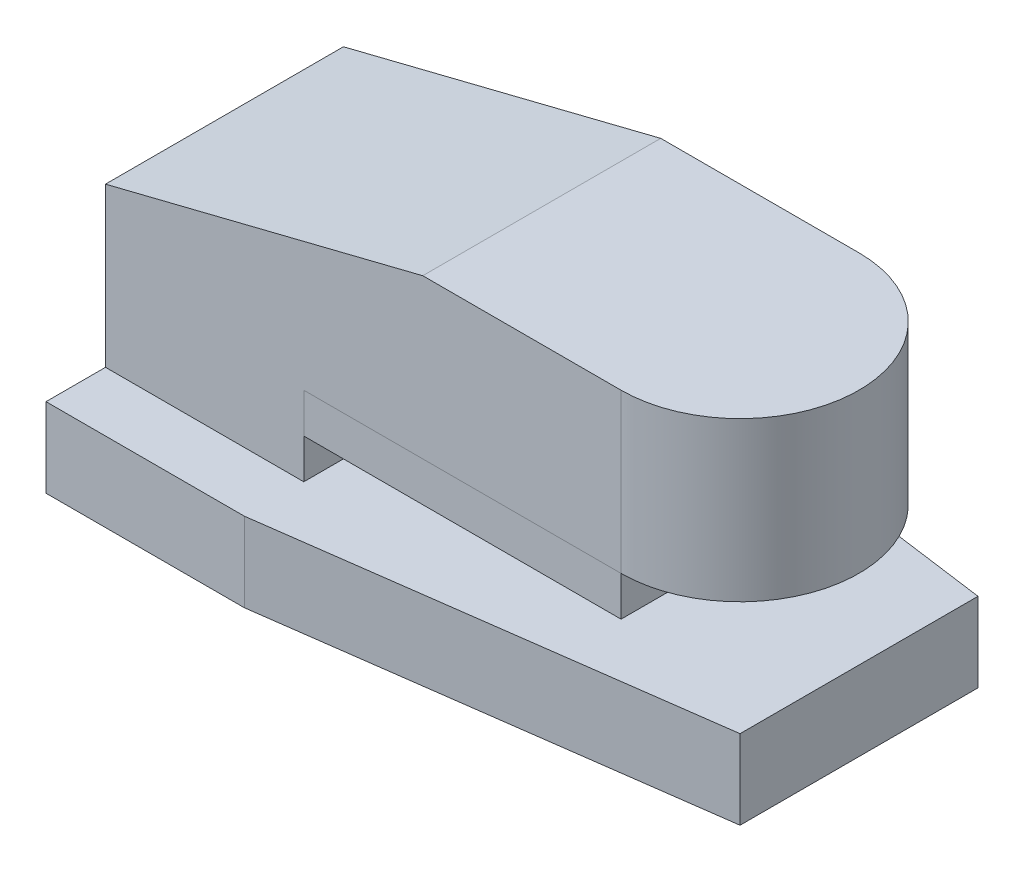
ISO-10303-21;
HEADER;
FILE_DESCRIPTION(('STEP AP214'),'2;1');
FILE_NAME('part.step','',(''),(''),'','','');
FILE_SCHEMA(('AUTOMOTIVE_DESIGN { 1 0 10303 214 1 1 1 1 }'));
ENDSEC;
DATA;
#1=APPLICATION_CONTEXT('core data for automotive mechanical design processes');
#2=APPLICATION_PROTOCOL_DEFINITION('international standard','automotive_design',2000,#1);
#3=PRODUCT_CONTEXT('',#1,'mechanical');
#4=PRODUCT('Part','Part','',(#3));
#5=PRODUCT_RELATED_PRODUCT_CATEGORY('part','',(#4));
#6=PRODUCT_DEFINITION_FORMATION('','',#4);
#7=PRODUCT_DEFINITION_CONTEXT('part definition',#1,'design');
#8=PRODUCT_DEFINITION('design','',#6,#7);
#9=PRODUCT_DEFINITION_SHAPE('','',#8);
#10=(LENGTH_UNIT() NAMED_UNIT(*) SI_UNIT(.MILLI.,.METRE.));
#11=(NAMED_UNIT(*) PLANE_ANGLE_UNIT() SI_UNIT($,.RADIAN.));
#12=(NAMED_UNIT(*) SI_UNIT($,.STERADIAN.) SOLID_ANGLE_UNIT());
#13=UNCERTAINTY_MEASURE_WITH_UNIT(LENGTH_MEASURE(1.E-05),#10,'distance_accuracy_value','');
#14=(GEOMETRIC_REPRESENTATION_CONTEXT(3) GLOBAL_UNCERTAINTY_ASSIGNED_CONTEXT((#13)) GLOBAL_UNIT_ASSIGNED_CONTEXT((#10,
#11,#12)) REPRESENTATION_CONTEXT('',''));
#15=CARTESIAN_POINT('',(0.,0.,0.));
#16=DIRECTION('',(0.,0.,1.));
#17=DIRECTION('',(1.,0.,0.));
#18=AXIS2_PLACEMENT_3D('',#15,#16,#17);
#19=CARTESIAN_POINT('',(130.,-83.0549270657776,-75.));
#20=DIRECTION('',(-1.,0.,0.));
#21=DIRECTION('',(0.,0.,1.));
#22=AXIS2_PLACEMENT_3D('',#19,#20,#21);
#23=PLANE('',#22);
#24=DIRECTION('',(0.,-1.,0.));
#25=VECTOR('',#24,1.);
#26=CARTESIAN_POINT('',(130.,-83.0549270657776,-15.));
#27=LINE('',#26,#25);
#28=CARTESIAN_POINT('',(130.,40.,-15.));
#29=VERTEX_POINT('',#28);
#30=CARTESIAN_POINT('',(130.,30.,-15.));
#31=VERTEX_POINT('',#30);
#32=EDGE_CURVE('E107',#29,#31,#27,.T.);
#33=ORIENTED_EDGE('',*,*,#32,.T.);
#34=DIRECTION('',(0.,0.,1.));
#35=VECTOR('',#34,1.);
#36=CARTESIAN_POINT('',(130.,30.,-75.));
#37=LINE('',#36,#35);
#38=CARTESIAN_POINT('',(130.,30.,-75.));
#39=VERTEX_POINT('',#38);
#40=EDGE_CURVE('E12',#39,#31,#37,.T.);
#41=ORIENTED_EDGE('',*,*,#40,.F.);
#42=DIRECTION('',(0.,-1.,0.));
#43=VECTOR('',#42,1.);
#44=CARTESIAN_POINT('',(130.,-83.0549270657776,-75.));
#45=LINE('',#44,#43);
#46=CARTESIAN_POINT('',(130.,40.,-75.));
#47=VERTEX_POINT('',#46);
#48=EDGE_CURVE('E62',#47,#39,#45,.T.);
#49=ORIENTED_EDGE('',*,*,#48,.F.);
#50=DIRECTION('',(0.,0.,1.));
#51=VECTOR('',#50,1.);
#52=CARTESIAN_POINT('',(130.,40.,-75.));
#53=LINE('',#52,#51);
#54=EDGE_CURVE('E47',#47,#29,#53,.T.);
#55=ORIENTED_EDGE('',*,*,#54,.T.);
#56=EDGE_LOOP('',(#33,#41,#49,#55));
#57=FACE_BOUND('',#56,.T.);
#58=ADVANCED_FACE('F44',(#57),#23,.F.);
#59=CARTESIAN_POINT('',(80.,30.,-75.));
#60=DIRECTION('',(0.,-1.,0.));
#61=DIRECTION('',(0.,0.,-1.));
#62=AXIS2_PLACEMENT_3D('',#59,#60,#61);
#63=PLANE('',#62);
#64=DIRECTION('',(1.,0.,0.));
#65=VECTOR('',#64,1.);
#66=CARTESIAN_POINT('',(80.,30.,-15.));
#67=LINE('',#66,#65);
#68=CARTESIAN_POINT('',(50.,30.,-15.));
#69=VERTEX_POINT('',#68);
#70=EDGE_CURVE('E103',#69,#31,#67,.T.);
#71=ORIENTED_EDGE('',*,*,#70,.F.);
#72=DIRECTION('',(0.,0.,1.));
#73=VECTOR('',#72,1.);
#74=CARTESIAN_POINT('',(50.,30.,-75.));
#75=LINE('',#74,#73);
#76=CARTESIAN_POINT('',(50.,30.,-75.));
#77=VERTEX_POINT('',#76);
#78=EDGE_CURVE('E53',#77,#69,#75,.T.);
#79=ORIENTED_EDGE('',*,*,#78,.F.);
#80=DIRECTION('',(1.,0.,0.));
#81=VECTOR('',#80,1.);
#82=CARTESIAN_POINT('',(80.,30.,-75.));
#83=LINE('',#82,#81);
#84=EDGE_CURVE('E92',#77,#39,#83,.T.);
#85=ORIENTED_EDGE('',*,*,#84,.T.);
#86=ORIENTED_EDGE('',*,*,#40,.T.);
#87=EDGE_LOOP('',(#71,#79,#85,#86));
#88=FACE_BOUND('',#87,.T.);
#89=ADVANCED_FACE('F117',(#88),#63,.T.);
#90=CARTESIAN_POINT('',(50.,-83.0549270657776,-75.));
#91=DIRECTION('',(1.,0.,0.));
#92=DIRECTION('',(0.,0.,-1.));
#93=AXIS2_PLACEMENT_3D('',#90,#91,#92);
#94=PLANE('',#93);
#95=DIRECTION('',(0.,1.,0.));
#96=VECTOR('',#95,1.);
#97=CARTESIAN_POINT('',(50.,-83.0549270657776,-15.));
#98=LINE('',#97,#96);
#99=CARTESIAN_POINT('',(50.,40.,-15.));
#100=VERTEX_POINT('',#99);
#101=EDGE_CURVE('E97',#69,#100,#98,.T.);
#102=ORIENTED_EDGE('',*,*,#101,.T.);
#103=DIRECTION('',(0.,0.,1.));
#104=VECTOR('',#103,1.);
#105=CARTESIAN_POINT('',(50.,40.,-75.));
#106=LINE('',#105,#104);
#107=CARTESIAN_POINT('',(50.,40.,-75.));
#108=VERTEX_POINT('',#107);
#109=EDGE_CURVE('E95',#108,#100,#106,.T.);
#110=ORIENTED_EDGE('',*,*,#109,.F.);
#111=DIRECTION('',(0.,1.,0.));
#112=VECTOR('',#111,1.);
#113=CARTESIAN_POINT('',(50.,-83.0549270657776,-75.));
#114=LINE('',#113,#112);
#115=EDGE_CURVE('E89',#77,#108,#114,.T.);
#116=ORIENTED_EDGE('',*,*,#115,.F.);
#117=ORIENTED_EDGE('',*,*,#78,.T.);
#118=EDGE_LOOP('',(#102,#110,#116,#117));
#119=FACE_BOUND('',#118,.T.);
#120=ADVANCED_FACE('F96',(#119),#94,.F.);
#121=CARTESIAN_POINT('',(80.,40.,-75.));
#122=DIRECTION('',(0.,-1.,0.));
#123=DIRECTION('',(1.,0.,0.));
#124=AXIS2_PLACEMENT_3D('',#121,#122,#123);
#125=PLANE('',#124);
#126=DIRECTION('',(1.,0.,0.));
#127=VECTOR('',#126,1.);
#128=CARTESIAN_POINT('',(80.,40.,-15.));
#129=LINE('',#128,#127);
#130=EDGE_CURVE('E109',#100,#29,#129,.T.);
#131=ORIENTED_EDGE('',*,*,#130,.T.);
#132=ORIENTED_EDGE('',*,*,#54,.F.);
#133=DIRECTION('',(1.,0.,0.));
#134=VECTOR('',#133,1.);
#135=CARTESIAN_POINT('',(80.,40.,-75.));
#136=LINE('',#135,#134);
#137=EDGE_CURVE('E87',#108,#47,#136,.T.);
#138=ORIENTED_EDGE('',*,*,#137,.F.);
#139=ORIENTED_EDGE('',*,*,#109,.T.);
#140=EDGE_LOOP('',(#131,#132,#138,#139));
#141=FACE_BOUND('',#140,.T.);
#142=ADVANCED_FACE('F100',(#141),#125,.F.);
#143=CARTESIAN_POINT('',(80.,-83.0549270657776,-75.));
#144=DIRECTION('',(0.,0.,1.));
#145=DIRECTION('',(1.,0.,0.));
#146=AXIS2_PLACEMENT_3D('',#143,#144,#145);
#147=PLANE('',#146);
#148=ORIENTED_EDGE('',*,*,#48,.T.);
#149=ORIENTED_EDGE('',*,*,#84,.F.);
#150=ORIENTED_EDGE('',*,*,#115,.T.);
#151=ORIENTED_EDGE('',*,*,#137,.T.);
#152=EDGE_LOOP('',(#148,#149,#150,#151));
#153=FACE_BOUND('',#152,.T.);
#154=ADVANCED_FACE('F91',(#153),#147,.F.);
#155=CARTESIAN_POINT('',(80.,-83.0549270657776,-15.));
#156=DIRECTION('',(0.,0.,1.));
#157=DIRECTION('',(1.,0.,0.));
#158=AXIS2_PLACEMENT_3D('',#155,#156,#157);
#159=PLANE('',#158);
#160=ORIENTED_EDGE('',*,*,#32,.F.);
#161=ORIENTED_EDGE('',*,*,#130,.F.);
#162=ORIENTED_EDGE('',*,*,#101,.F.);
#163=ORIENTED_EDGE('',*,*,#70,.T.);
#164=EDGE_LOOP('',(#160,#161,#162,#163));
#165=FACE_BOUND('',#164,.T.);
#166=ADVANCED_FACE('F116',(#165),#159,.T.);
#167=CLOSED_SHELL('',(#58,#89,#120,#142,#154,#166));
#168=MANIFOLD_SOLID_BREP('B2',#167);
#169=CARTESIAN_POINT('',(80.,80.,-75.));
#170=DIRECTION('',(0.,1.,0.));
#171=DIRECTION('',(0.,0.,1.));
#172=AXIS2_PLACEMENT_3D('',#169,#170,#171);
#173=PLANE('',#172);
#174=CARTESIAN_POINT('',(130.,80.,-45.));
#175=DIRECTION('',(0.,1.,0.));
#176=DIRECTION('',(0.,0.,1.));
#177=AXIS2_PLACEMENT_3D('',#174,#175,#176);
#178=CIRCLE('',#177,30.);
#179=CARTESIAN_POINT('',(130.,80.,-15.));
#180=VERTEX_POINT('',#179);
#181=CARTESIAN_POINT('',(130.,80.,-75.));
#182=VERTEX_POINT('',#181);
#183=EDGE_CURVE('E200',#180,#182,#178,.T.);
#184=ORIENTED_EDGE('',*,*,#183,.T.);
#185=DIRECTION('',(-1.,0.,0.));
#186=VECTOR('',#185,1.);
#187=CARTESIAN_POINT('',(80.,80.,-75.));
#188=LINE('',#187,#186);
#189=CARTESIAN_POINT('',(80.,80.,-75.));
#190=VERTEX_POINT('',#189);
#191=EDGE_CURVE('E246',#182,#190,#188,.T.);
#192=ORIENTED_EDGE('',*,*,#191,.T.);
#193=DIRECTION('',(0.,0.,1.));
#194=VECTOR('',#193,1.);
#195=CARTESIAN_POINT('',(80.,80.,-75.));
#196=LINE('',#195,#194);
#197=CARTESIAN_POINT('',(80.,80.,-15.));
#198=VERTEX_POINT('',#197);
#199=EDGE_CURVE('E249',#190,#198,#196,.T.);
#200=ORIENTED_EDGE('',*,*,#199,.T.);
#201=DIRECTION('',(-1.,0.,0.));
#202=VECTOR('',#201,1.);
#203=CARTESIAN_POINT('',(80.,80.,-15.));
#204=LINE('',#203,#202);
#205=EDGE_CURVE('E282',#180,#198,#204,.T.);
#206=ORIENTED_EDGE('',*,*,#205,.F.);
#207=EDGE_LOOP('',(#184,#192,#200,#206));
#208=FACE_BOUND('',#207,.T.);
#209=ADVANCED_FACE('F183',(#208),#173,.T.);
#210=CARTESIAN_POINT('',(160.,40.,-75.));
#211=DIRECTION('',(0.,-1.,0.));
#212=DIRECTION('',(1.,0.,0.));
#213=AXIS2_PLACEMENT_3D('',#210,#211,#212);
#214=PLANE('',#213);
#215=DIRECTION('',(1.,0.,0.));
#216=VECTOR('',#215,1.);
#217=CARTESIAN_POINT('',(160.,40.,-75.));
#218=LINE('',#217,#216);
#219=CARTESIAN_POINT('',(50.,40.,-75.));
#220=VERTEX_POINT('',#219);
#221=CARTESIAN_POINT('',(130.,40.,-75.));
#222=VERTEX_POINT('',#221);
#223=EDGE_CURVE('E256',#220,#222,#218,.T.);
#224=ORIENTED_EDGE('',*,*,#223,.T.);
#225=CARTESIAN_POINT('',(130.,40.,-45.));
#226=DIRECTION('',(0.,1.,0.));
#227=DIRECTION('',(0.,0.,1.));
#228=AXIS2_PLACEMENT_3D('',#225,#226,#227);
#229=CIRCLE('',#228,30.);
#230=CARTESIAN_POINT('',(130.,40.,-15.));
#231=VERTEX_POINT('',#230);
#232=EDGE_CURVE('E375',#231,#222,#229,.T.);
#233=ORIENTED_EDGE('',*,*,#232,.F.);
#234=DIRECTION('',(1.,0.,0.));
#235=VECTOR('',#234,1.);
#236=CARTESIAN_POINT('',(160.,40.,-15.));
#237=LINE('',#236,#235);
#238=CARTESIAN_POINT('',(50.,40.,-15.));
#239=VERTEX_POINT('',#238);
#240=EDGE_CURVE('E279',#239,#231,#237,.T.);
#241=ORIENTED_EDGE('',*,*,#240,.F.);
#242=DIRECTION('',(0.,0.,1.));
#243=VECTOR('',#242,1.);
#244=CARTESIAN_POINT('',(50.,40.,-75.));
#245=LINE('',#244,#243);
#246=EDGE_CURVE('E264',#220,#239,#245,.T.);
#247=ORIENTED_EDGE('',*,*,#246,.F.);
#248=EDGE_LOOP('',(#224,#233,#241,#247));
#249=FACE_BOUND('',#248,.T.);
#250=ADVANCED_FACE('F301',(#249),#214,.T.);
#251=CARTESIAN_POINT('',(50.,20.,-75.));
#252=DIRECTION('',(0.,-1.,0.));
#253=DIRECTION('',(0.,0.,-1.));
#254=AXIS2_PLACEMENT_3D('',#251,#252,#253);
#255=PLANE('',#254);
#256=DIRECTION('',(1.,0.,0.));
#257=VECTOR('',#256,1.);
#258=CARTESIAN_POINT('',(50.,20.,-15.));
#259=LINE('',#258,#257);
#260=CARTESIAN_POINT('',(0.,20.,-15.));
#261=VERTEX_POINT('',#260);
#262=CARTESIAN_POINT('',(50.,20.,-15.));
#263=VERTEX_POINT('',#262);
#264=EDGE_CURVE('E272',#261,#263,#259,.T.);
#265=ORIENTED_EDGE('',*,*,#264,.F.);
#266=DIRECTION('',(0.,0.,1.));
#267=VECTOR('',#266,1.);
#268=CARTESIAN_POINT('',(0.,20.,-75.));
#269=LINE('',#268,#267);
#270=CARTESIAN_POINT('',(0.,20.,-75.));
#271=VERTEX_POINT('',#270);
#272=EDGE_CURVE('E42',#271,#261,#269,.T.);
#273=ORIENTED_EDGE('',*,*,#272,.F.);
#274=DIRECTION('',(1.,0.,0.));
#275=VECTOR('',#274,1.);
#276=CARTESIAN_POINT('',(50.,20.,-75.));
#277=LINE('',#276,#275);
#278=CARTESIAN_POINT('',(50.,20.,-75.));
#279=VERTEX_POINT('',#278);
#280=EDGE_CURVE('E287',#271,#279,#277,.T.);
#281=ORIENTED_EDGE('',*,*,#280,.T.);
#282=DIRECTION('',(0.,0.,1.));
#283=VECTOR('',#282,1.);
#284=CARTESIAN_POINT('',(50.,20.,-75.));
#285=LINE('',#284,#283);
#286=EDGE_CURVE('E187',#279,#263,#285,.T.);
#287=ORIENTED_EDGE('',*,*,#286,.T.);
#288=EDGE_LOOP('',(#265,#273,#281,#287));
#289=FACE_BOUND('',#288,.T.);
#290=ADVANCED_FACE('F185',(#289),#255,.T.);
#291=CARTESIAN_POINT('',(0.,20.,-75.));
#292=DIRECTION('',(-1.,0.,0.));
#293=DIRECTION('',(0.,0.,1.));
#294=AXIS2_PLACEMENT_3D('',#291,#292,#293);
#295=PLANE('',#294);
#296=DIRECTION('',(0.,-1.,0.));
#297=VECTOR('',#296,1.);
#298=CARTESIAN_POINT('',(0.,20.,-15.));
#299=LINE('',#298,#297);
#300=CARTESIAN_POINT('',(0.,60.,-15.));
#301=VERTEX_POINT('',#300);
#302=EDGE_CURVE('E285',#301,#261,#299,.T.);
#303=ORIENTED_EDGE('',*,*,#302,.F.);
#304=DIRECTION('',(0.,0.,1.));
#305=VECTOR('',#304,1.);
#306=CARTESIAN_POINT('',(0.,60.,-75.));
#307=LINE('',#306,#305);
#308=CARTESIAN_POINT('',(0.,60.,-75.));
#309=VERTEX_POINT('',#308);
#310=EDGE_CURVE('E192',#309,#301,#307,.T.);
#311=ORIENTED_EDGE('',*,*,#310,.F.);
#312=DIRECTION('',(0.,-1.,0.));
#313=VECTOR('',#312,1.);
#314=CARTESIAN_POINT('',(0.,20.,-75.));
#315=LINE('',#314,#313);
#316=EDGE_CURVE('E267',#309,#271,#315,.T.);
#317=ORIENTED_EDGE('',*,*,#316,.T.);
#318=ORIENTED_EDGE('',*,*,#272,.T.);
#319=EDGE_LOOP('',(#303,#311,#317,#318));
#320=FACE_BOUND('',#319,.T.);
#321=ADVANCED_FACE('F293',(#320),#295,.T.);
#322=CARTESIAN_POINT('',(0.,60.,-75.));
#323=DIRECTION('',(-0.242535625036333,0.970142500145332,0.));
#324=DIRECTION('',(-0.970142500145332,-0.242535625036333,0.));
#325=AXIS2_PLACEMENT_3D('',#322,#323,#324);
#326=PLANE('',#325);
#327=DIRECTION('',(-0.970142500145332,-0.242535625036333,0.));
#328=VECTOR('',#327,1.);
#329=CARTESIAN_POINT('',(0.,60.,-15.));
#330=LINE('',#329,#328);
#331=EDGE_CURVE('E263',#198,#301,#330,.T.);
#332=ORIENTED_EDGE('',*,*,#331,.F.);
#333=ORIENTED_EDGE('',*,*,#199,.F.);
#334=DIRECTION('',(-0.970142500145332,-0.242535625036333,0.));
#335=VECTOR('',#334,1.);
#336=CARTESIAN_POINT('',(0.,60.,-75.));
#337=LINE('',#336,#335);
#338=EDGE_CURVE('E255',#190,#309,#337,.T.);
#339=ORIENTED_EDGE('',*,*,#338,.T.);
#340=ORIENTED_EDGE('',*,*,#310,.T.);
#341=EDGE_LOOP('',(#332,#333,#339,#340));
#342=FACE_BOUND('',#341,.T.);
#343=ADVANCED_FACE('F260',(#342),#326,.T.);
#344=CARTESIAN_POINT('',(50.,40.,-75.));
#345=DIRECTION('',(1.,0.,0.));
#346=DIRECTION('',(0.,0.,-1.));
#347=AXIS2_PLACEMENT_3D('',#344,#345,#346);
#348=PLANE('',#347);
#349=DIRECTION('',(0.,1.,0.));
#350=VECTOR('',#349,1.);
#351=CARTESIAN_POINT('',(50.,40.,-15.));
#352=LINE('',#351,#350);
#353=EDGE_CURVE('E275',#263,#239,#352,.T.);
#354=ORIENTED_EDGE('',*,*,#353,.F.);
#355=ORIENTED_EDGE('',*,*,#286,.F.);
#356=DIRECTION('',(0.,1.,0.));
#357=VECTOR('',#356,1.);
#358=CARTESIAN_POINT('',(50.,40.,-75.));
#359=LINE('',#358,#357);
#360=EDGE_CURVE('E376',#279,#220,#359,.T.);
#361=ORIENTED_EDGE('',*,*,#360,.T.);
#362=ORIENTED_EDGE('',*,*,#246,.T.);
#363=EDGE_LOOP('',(#354,#355,#361,#362));
#364=FACE_BOUND('',#363,.T.);
#365=ADVANCED_FACE('F290',(#364),#348,.T.);
#366=CARTESIAN_POINT('',(0.,20.,-75.));
#367=DIRECTION('',(0.,0.,-1.));
#368=DIRECTION('',(-1.,0.,0.));
#369=AXIS2_PLACEMENT_3D('',#366,#367,#368);
#370=PLANE('',#369);
#371=DIRECTION('',(0.,1.,0.));
#372=VECTOR('',#371,1.);
#373=CARTESIAN_POINT('',(130.,40.,-75.));
#374=LINE('',#373,#372);
#375=EDGE_CURVE('E382',#222,#182,#374,.T.);
#376=ORIENTED_EDGE('',*,*,#375,.F.);
#377=ORIENTED_EDGE('',*,*,#223,.F.);
#378=ORIENTED_EDGE('',*,*,#360,.F.);
#379=ORIENTED_EDGE('',*,*,#280,.F.);
#380=ORIENTED_EDGE('',*,*,#316,.F.);
#381=ORIENTED_EDGE('',*,*,#338,.F.);
#382=ORIENTED_EDGE('',*,*,#191,.F.);
#383=EDGE_LOOP('',(#376,#377,#378,#379,#380,#381,#382));
#384=FACE_BOUND('',#383,.T.);
#385=ADVANCED_FACE('F266',(#384),#370,.T.);
#386=CARTESIAN_POINT('',(0.,20.,-15.));
#387=DIRECTION('',(0.,0.,-1.));
#388=DIRECTION('',(-1.,0.,0.));
#389=AXIS2_PLACEMENT_3D('',#386,#387,#388);
#390=PLANE('',#389);
#391=ORIENTED_EDGE('',*,*,#240,.T.);
#392=DIRECTION('',(0.,1.,0.));
#393=VECTOR('',#392,1.);
#394=CARTESIAN_POINT('',(130.,40.,-15.));
#395=LINE('',#394,#393);
#396=EDGE_CURVE('E276',#231,#180,#395,.T.);
#397=ORIENTED_EDGE('',*,*,#396,.T.);
#398=ORIENTED_EDGE('',*,*,#205,.T.);
#399=ORIENTED_EDGE('',*,*,#331,.T.);
#400=ORIENTED_EDGE('',*,*,#302,.T.);
#401=ORIENTED_EDGE('',*,*,#264,.T.);
#402=ORIENTED_EDGE('',*,*,#353,.T.);
#403=EDGE_LOOP('',(#391,#397,#398,#399,#400,#401,#402));
#404=FACE_BOUND('',#403,.T.);
#405=ADVANCED_FACE('F292',(#404),#390,.F.);
#406=CARTESIAN_POINT('',(130.,40.,-45.));
#407=DIRECTION('',(0.,1.,0.));
#408=DIRECTION('',(0.,0.,1.));
#409=AXIS2_PLACEMENT_3D('',#406,#407,#408);
#410=CYLINDRICAL_SURFACE('',#409,30.);
#411=ORIENTED_EDGE('',*,*,#183,.F.);
#412=ORIENTED_EDGE('',*,*,#396,.F.);
#413=ORIENTED_EDGE('',*,*,#232,.T.);
#414=ORIENTED_EDGE('',*,*,#375,.T.);
#415=EDGE_LOOP('',(#411,#412,#413,#414));
#416=FACE_BOUND('',#415,.T.);
#417=ADVANCED_FACE('F318',(#416),#410,.T.);
#418=CLOSED_SHELL('',(#209,#250,#290,#321,#343,#365,#385,#405,#417));
#419=MANIFOLD_SOLID_BREP('B6',#418);
#420=CARTESIAN_POINT('',(0.,20.,0.));
#421=DIRECTION('',(1.,0.,0.));
#422=DIRECTION('',(0.,0.,-1.));
#423=AXIS2_PLACEMENT_3D('',#420,#421,#422);
#424=PLANE('',#423);
#425=DIRECTION('',(0.,0.,1.));
#426=VECTOR('',#425,1.);
#427=CARTESIAN_POINT('',(0.,0.,0.));
#428=LINE('',#427,#426);
#429=CARTESIAN_POINT('',(0.,0.,-90.));
#430=VERTEX_POINT('',#429);
#431=CARTESIAN_POINT('',(0.,0.,0.));
#432=VERTEX_POINT('',#431);
#433=EDGE_CURVE('E472',#430,#432,#428,.T.);
#434=ORIENTED_EDGE('',*,*,#433,.T.);
#435=DIRECTION('',(0.,-1.,0.));
#436=VECTOR('',#435,1.);
#437=CARTESIAN_POINT('',(0.,20.,0.));
#438=LINE('',#437,#436);
#439=CARTESIAN_POINT('',(0.,20.,0.));
#440=VERTEX_POINT('',#439);
#441=EDGE_CURVE('E181',#440,#432,#438,.T.);
#442=ORIENTED_EDGE('',*,*,#441,.F.);
#443=DIRECTION('',(0.,0.,1.));
#444=VECTOR('',#443,1.);
#445=CARTESIAN_POINT('',(0.,20.,0.));
#446=LINE('',#445,#444);
#447=CARTESIAN_POINT('',(0.,20.,-90.));
#448=VERTEX_POINT('',#447);
#449=EDGE_CURVE('E482',#448,#440,#446,.T.);
#450=ORIENTED_EDGE('',*,*,#449,.F.);
#451=DIRECTION('',(0.,-1.,0.));
#452=VECTOR('',#451,1.);
#453=CARTESIAN_POINT('',(0.,20.,-90.));
#454=LINE('',#453,#452);
#455=EDGE_CURVE('E468',#448,#430,#454,.T.);
#456=ORIENTED_EDGE('',*,*,#455,.T.);
#457=EDGE_LOOP('',(#434,#442,#450,#456));
#458=FACE_BOUND('',#457,.T.);
#459=ADVANCED_FACE('F388',(#458),#424,.F.);
#460=CARTESIAN_POINT('',(0.,20.,0.));
#461=DIRECTION('',(0.,0.,-1.));
#462=DIRECTION('',(-1.,0.,0.));
#463=AXIS2_PLACEMENT_3D('',#460,#461,#462);
#464=PLANE('',#463);
#465=DIRECTION('',(1.,0.,0.));
#466=VECTOR('',#465,1.);
#467=CARTESIAN_POINT('',(0.,0.,0.));
#468=LINE('',#467,#466);
#469=CARTESIAN_POINT('',(50.,0.,0.));
#470=VERTEX_POINT('',#469);
#471=EDGE_CURVE('E475',#432,#470,#468,.T.);
#472=ORIENTED_EDGE('',*,*,#471,.T.);
#473=DIRECTION('',(0.,-1.,0.));
#474=VECTOR('',#473,1.);
#475=CARTESIAN_POINT('',(50.,20.,0.));
#476=LINE('',#475,#474);
#477=CARTESIAN_POINT('',(50.,20.,0.));
#478=VERTEX_POINT('',#477);
#479=EDGE_CURVE('E396',#478,#470,#476,.T.);
#480=ORIENTED_EDGE('',*,*,#479,.F.);
#481=DIRECTION('',(1.,0.,0.));
#482=VECTOR('',#481,1.);
#483=CARTESIAN_POINT('',(0.,20.,0.));
#484=LINE('',#483,#482);
#485=EDGE_CURVE('E441',#440,#478,#484,.T.);
#486=ORIENTED_EDGE('',*,*,#485,.F.);
#487=ORIENTED_EDGE('',*,*,#441,.T.);
#488=EDGE_LOOP('',(#472,#480,#486,#487));
#489=FACE_BOUND('',#488,.T.);
#490=ADVANCED_FACE('F506',(#489),#464,.F.);
#491=CARTESIAN_POINT('',(50.,20.,0.));
#492=DIRECTION('',(-0.135113204733313,0.,-0.990830168044299));
#493=DIRECTION('',(-0.990830168044299,0.,0.135113204733313));
#494=AXIS2_PLACEMENT_3D('',#491,#492,#493);
#495=PLANE('',#494);
#496=DIRECTION('',(0.990830168044299,0.,-0.135113204733313));
#497=VECTOR('',#496,1.);
#498=CARTESIAN_POINT('',(50.,0.,0.));
#499=LINE('',#498,#497);
#500=CARTESIAN_POINT('',(160.,0.,-15.));
#501=VERTEX_POINT('',#500);
#502=EDGE_CURVE('E477',#470,#501,#499,.T.);
#503=ORIENTED_EDGE('',*,*,#502,.T.);
#504=DIRECTION('',(0.,-1.,0.));
#505=VECTOR('',#504,1.);
#506=CARTESIAN_POINT('',(160.,20.,-15.));
#507=LINE('',#506,#505);
#508=CARTESIAN_POINT('',(160.,20.,-15.));
#509=VERTEX_POINT('',#508);
#510=EDGE_CURVE('E463',#509,#501,#507,.T.);
#511=ORIENTED_EDGE('',*,*,#510,.F.);
#512=DIRECTION('',(0.990830168044299,0.,-0.135113204733313));
#513=VECTOR('',#512,1.);
#514=CARTESIAN_POINT('',(50.,20.,0.));
#515=LINE('',#514,#513);
#516=EDGE_CURVE('E454',#478,#509,#515,.T.);
#517=ORIENTED_EDGE('',*,*,#516,.F.);
#518=ORIENTED_EDGE('',*,*,#479,.T.);
#519=EDGE_LOOP('',(#503,#511,#517,#518));
#520=FACE_BOUND('',#519,.T.);
#521=ADVANCED_FACE('F488',(#520),#495,.F.);
#522=CARTESIAN_POINT('',(160.,20.,-15.));
#523=DIRECTION('',(-1.,0.,0.));
#524=DIRECTION('',(0.,0.,1.));
#525=AXIS2_PLACEMENT_3D('',#522,#523,#524);
#526=PLANE('',#525);
#527=DIRECTION('',(0.,0.,-1.));
#528=VECTOR('',#527,1.);
#529=CARTESIAN_POINT('',(160.,0.,-15.));
#530=LINE('',#529,#528);
#531=CARTESIAN_POINT('',(160.,0.,-75.));
#532=VERTEX_POINT('',#531);
#533=EDGE_CURVE('E462',#501,#532,#530,.T.);
#534=ORIENTED_EDGE('',*,*,#533,.T.);
#535=DIRECTION('',(0.,-1.,0.));
#536=VECTOR('',#535,1.);
#537=CARTESIAN_POINT('',(160.,20.,-75.));
#538=LINE('',#537,#536);
#539=CARTESIAN_POINT('',(160.,20.,-75.));
#540=VERTEX_POINT('',#539);
#541=EDGE_CURVE('E459',#540,#532,#538,.T.);
#542=ORIENTED_EDGE('',*,*,#541,.F.);
#543=DIRECTION('',(0.,0.,-1.));
#544=VECTOR('',#543,1.);
#545=CARTESIAN_POINT('',(160.,20.,-15.));
#546=LINE('',#545,#544);
#547=EDGE_CURVE('E448',#509,#540,#546,.T.);
#548=ORIENTED_EDGE('',*,*,#547,.F.);
#549=ORIENTED_EDGE('',*,*,#510,.T.);
#550=EDGE_LOOP('',(#534,#542,#548,#549));
#551=FACE_BOUND('',#550,.T.);
#552=ADVANCED_FACE('F460',(#551),#526,.F.);
#553=CARTESIAN_POINT('',(160.,20.,-75.));
#554=DIRECTION('',(-0.135113204733313,0.,0.990830168044299));
#555=DIRECTION('',(0.990830168044299,0.,0.135113204733313));
#556=AXIS2_PLACEMENT_3D('',#553,#554,#555);
#557=PLANE('',#556);
#558=DIRECTION('',(-0.990830168044299,0.,-0.135113204733313));
#559=VECTOR('',#558,1.);
#560=CARTESIAN_POINT('',(160.,0.,-75.));
#561=LINE('',#560,#559);
#562=CARTESIAN_POINT('',(50.,0.,-90.));
#563=VERTEX_POINT('',#562);
#564=EDGE_CURVE('E427',#532,#563,#561,.T.);
#565=ORIENTED_EDGE('',*,*,#564,.T.);
#566=DIRECTION('',(0.,-1.,0.));
#567=VECTOR('',#566,1.);
#568=CARTESIAN_POINT('',(50.,20.,-90.));
#569=LINE('',#568,#567);
#570=CARTESIAN_POINT('',(50.,20.,-90.));
#571=VERTEX_POINT('',#570);
#572=EDGE_CURVE('E464',#571,#563,#569,.T.);
#573=ORIENTED_EDGE('',*,*,#572,.F.);
#574=DIRECTION('',(-0.990830168044299,0.,-0.135113204733313));
#575=VECTOR('',#574,1.);
#576=CARTESIAN_POINT('',(160.,20.,-75.));
#577=LINE('',#576,#575);
#578=EDGE_CURVE('E452',#540,#571,#577,.T.);
#579=ORIENTED_EDGE('',*,*,#578,.F.);
#580=ORIENTED_EDGE('',*,*,#541,.T.);
#581=EDGE_LOOP('',(#565,#573,#579,#580));
#582=FACE_BOUND('',#581,.T.);
#583=ADVANCED_FACE('F466',(#582),#557,.F.);
#584=CARTESIAN_POINT('',(0.,20.,-90.));
#585=DIRECTION('',(0.,0.,1.));
#586=DIRECTION('',(1.,0.,0.));
#587=AXIS2_PLACEMENT_3D('',#584,#585,#586);
#588=PLANE('',#587);
#589=DIRECTION('',(-1.,0.,0.));
#590=VECTOR('',#589,1.);
#591=CARTESIAN_POINT('',(0.,0.,-90.));
#592=LINE('',#591,#590);
#593=EDGE_CURVE('E433',#563,#430,#592,.T.);
#594=ORIENTED_EDGE('',*,*,#593,.T.);
#595=ORIENTED_EDGE('',*,*,#455,.F.);
#596=DIRECTION('',(-1.,0.,0.));
#597=VECTOR('',#596,1.);
#598=CARTESIAN_POINT('',(0.,20.,-90.));
#599=LINE('',#598,#597);
#600=EDGE_CURVE('E404',#571,#448,#599,.T.);
#601=ORIENTED_EDGE('',*,*,#600,.F.);
#602=ORIENTED_EDGE('',*,*,#572,.T.);
#603=EDGE_LOOP('',(#594,#595,#601,#602));
#604=FACE_BOUND('',#603,.T.);
#605=ADVANCED_FACE('F495',(#604),#588,.F.);
#606=CARTESIAN_POINT('',(0.,20.,-90.));
#607=DIRECTION('',(0.,-1.,0.));
#608=DIRECTION('',(0.,0.,-1.));
#609=AXIS2_PLACEMENT_3D('',#606,#607,#608);
#610=PLANE('',#609);
#611=ORIENTED_EDGE('',*,*,#449,.T.);
#612=ORIENTED_EDGE('',*,*,#485,.T.);
#613=ORIENTED_EDGE('',*,*,#516,.T.);
#614=ORIENTED_EDGE('',*,*,#547,.T.);
#615=ORIENTED_EDGE('',*,*,#578,.T.);
#616=ORIENTED_EDGE('',*,*,#600,.T.);
#617=EDGE_LOOP('',(#611,#612,#613,#614,#615,#616));
#618=FACE_BOUND('',#617,.T.);
#619=ADVANCED_FACE('F450',(#618),#610,.F.);
#620=CARTESIAN_POINT('',(0.,0.,-90.));
#621=DIRECTION('',(0.,-1.,0.));
#622=DIRECTION('',(0.,0.,-1.));
#623=AXIS2_PLACEMENT_3D('',#620,#621,#622);
#624=PLANE('',#623);
#625=ORIENTED_EDGE('',*,*,#433,.F.);
#626=ORIENTED_EDGE('',*,*,#593,.F.);
#627=ORIENTED_EDGE('',*,*,#564,.F.);
#628=ORIENTED_EDGE('',*,*,#533,.F.);
#629=ORIENTED_EDGE('',*,*,#502,.F.);
#630=ORIENTED_EDGE('',*,*,#471,.F.);
#631=EDGE_LOOP('',(#625,#626,#627,#628,#629,#630));
#632=FACE_BOUND('',#631,.T.);
#633=ADVANCED_FACE('F491',(#632),#624,.T.);
#634=CLOSED_SHELL('',(#459,#490,#521,#552,#583,#605,#619,#633));
#635=MANIFOLD_SOLID_BREP('B36',#634);
#636=ADVANCED_BREP_SHAPE_REPRESENTATION('',(#18,#168,#419,#635),#14);
#637=SHAPE_DEFINITION_REPRESENTATION(#9,#636);
ENDSEC;
END-ISO-10303-21;
